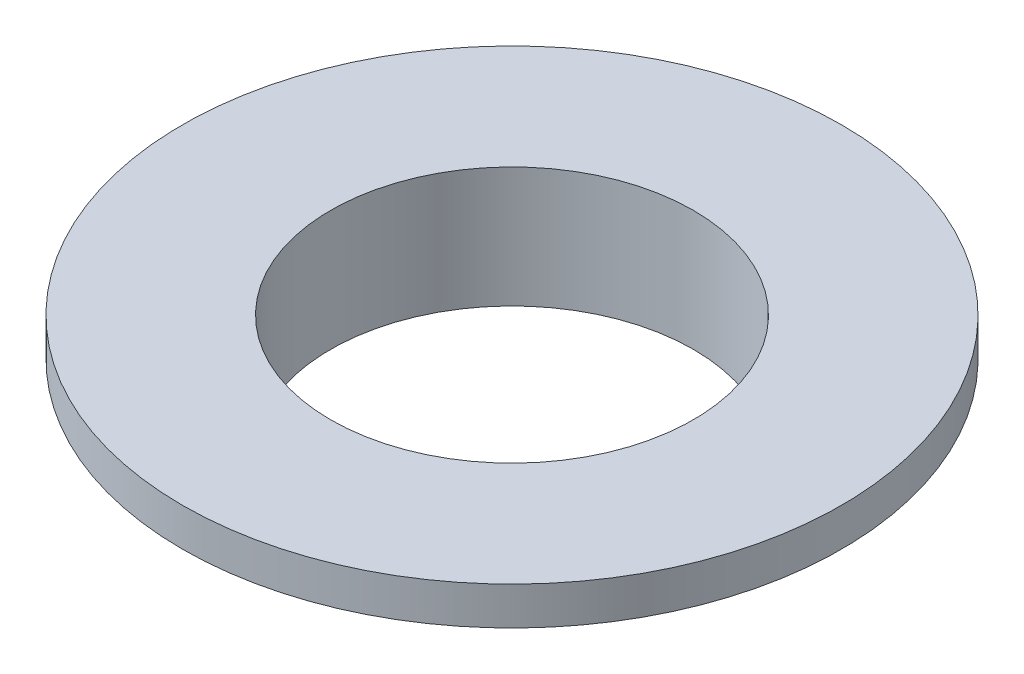
ISO-10303-21;
HEADER;
FILE_DESCRIPTION(('STEP AP214'),'2;1');
FILE_NAME('part.step','',(''),(''),'','','');
FILE_SCHEMA(('AUTOMOTIVE_DESIGN { 1 0 10303 214 1 1 1 1 }'));
ENDSEC;
DATA;
#1=APPLICATION_CONTEXT('core data for automotive mechanical design processes');
#2=APPLICATION_PROTOCOL_DEFINITION('international standard','automotive_design',2000,#1);
#3=PRODUCT_CONTEXT('',#1,'mechanical');
#4=PRODUCT('Part','Part','',(#3));
#5=PRODUCT_RELATED_PRODUCT_CATEGORY('part','',(#4));
#6=PRODUCT_DEFINITION_FORMATION('','',#4);
#7=PRODUCT_DEFINITION_CONTEXT('part definition',#1,'design');
#8=PRODUCT_DEFINITION('design','',#6,#7);
#9=PRODUCT_DEFINITION_SHAPE('','',#8);
#10=(LENGTH_UNIT() NAMED_UNIT(*) SI_UNIT(.MILLI.,.METRE.));
#11=(NAMED_UNIT(*) PLANE_ANGLE_UNIT() SI_UNIT($,.RADIAN.));
#12=(NAMED_UNIT(*) SI_UNIT($,.STERADIAN.) SOLID_ANGLE_UNIT());
#13=UNCERTAINTY_MEASURE_WITH_UNIT(LENGTH_MEASURE(1.E-05),#10,'distance_accuracy_value','');
#14=(GEOMETRIC_REPRESENTATION_CONTEXT(3) GLOBAL_UNCERTAINTY_ASSIGNED_CONTEXT((#13)) GLOBAL_UNIT_ASSIGNED_CONTEXT((#10,
#11,#12)) REPRESENTATION_CONTEXT('',''));
#15=CARTESIAN_POINT('',(0.,0.,0.));
#16=DIRECTION('',(0.,0.,1.));
#17=DIRECTION('',(1.,0.,0.));
#18=AXIS2_PLACEMENT_3D('',#15,#16,#17);
#19=CARTESIAN_POINT('',(0.,1.5,0.));
#20=DIRECTION('',(0.,-1.,0.));
#21=DIRECTION('',(0.,0.,-1.));
#22=AXIS2_PLACEMENT_3D('',#19,#20,#21);
#23=CYLINDRICAL_SURFACE('',#22,13.);
#24=CARTESIAN_POINT('',(0.,1.5,0.));
#25=DIRECTION('',(0.,1.,0.));
#26=DIRECTION('',(0.,0.,1.));
#27=AXIS2_PLACEMENT_3D('',#24,#25,#26);
#28=CIRCLE('',#27,13.);
#29=CARTESIAN_POINT('',(0.,1.5,13.));
#30=VERTEX_POINT('',#29);
#31=EDGE_CURVE('E51',#30,#30,#28,.T.);
#32=ORIENTED_EDGE('',*,*,#31,.F.);
#33=EDGE_LOOP('',(#32));
#34=FACE_BOUND('',#33,.T.);
#35=CARTESIAN_POINT('',(0.,0.,0.));
#36=DIRECTION('',(0.,1.,0.));
#37=DIRECTION('',(0.,0.,1.));
#38=AXIS2_PLACEMENT_3D('',#35,#36,#37);
#39=CIRCLE('',#38,13.);
#40=CARTESIAN_POINT('',(0.,0.,13.));
#41=VERTEX_POINT('',#40);
#42=EDGE_CURVE('E46',#41,#41,#39,.T.);
#43=ORIENTED_EDGE('',*,*,#42,.T.);
#44=EDGE_LOOP('',(#43));
#45=FACE_BOUND('',#44,.T.);
#46=ADVANCED_FACE('F43',(#34,#45),#23,.T.);
#47=CARTESIAN_POINT('',(0.,1.5,0.));
#48=DIRECTION('',(0.,1.,0.));
#49=DIRECTION('',(0.,0.,1.));
#50=AXIS2_PLACEMENT_3D('',#47,#48,#49);
#51=PLANE('',#50);
#52=CARTESIAN_POINT('',(0.,1.5,0.));
#53=DIRECTION('',(0.,1.,0.));
#54=DIRECTION('',(0.,0.,1.));
#55=AXIS2_PLACEMENT_3D('',#52,#53,#54);
#56=CIRCLE('',#55,7.1554);
#57=CARTESIAN_POINT('',(0.,1.5,7.1554));
#58=VERTEX_POINT('',#57);
#59=EDGE_CURVE('E63',#58,#58,#56,.T.);
#60=ORIENTED_EDGE('',*,*,#59,.F.);
#61=EDGE_LOOP('',(#60));
#62=FACE_BOUND('',#61,.T.);
#63=ORIENTED_EDGE('',*,*,#31,.T.);
#64=EDGE_LOOP('',(#63));
#65=FACE_BOUND('',#64,.T.);
#66=ADVANCED_FACE('F80',(#62,#65),#51,.T.);
#67=CARTESIAN_POINT('',(0.,0.,0.));
#68=DIRECTION('',(0.,1.,0.));
#69=DIRECTION('',(0.,0.,1.));
#70=AXIS2_PLACEMENT_3D('',#67,#68,#69);
#71=PLANE('',#70);
#72=CARTESIAN_POINT('',(0.,0.,0.));
#73=DIRECTION('',(0.,-1.,0.));
#74=DIRECTION('',(0.,0.,-1.));
#75=AXIS2_PLACEMENT_3D('',#72,#73,#74);
#76=CIRCLE('',#75,7.75);
#77=CARTESIAN_POINT('',(0.,0.,-7.75));
#78=VERTEX_POINT('',#77);
#79=EDGE_CURVE('E10',#78,#78,#76,.T.);
#80=ORIENTED_EDGE('',*,*,#79,.F.);
#81=EDGE_LOOP('',(#80));
#82=FACE_BOUND('',#81,.T.);
#83=ORIENTED_EDGE('',*,*,#42,.F.);
#84=EDGE_LOOP('',(#83));
#85=FACE_BOUND('',#84,.T.);
#86=ADVANCED_FACE('F83',(#82,#85),#71,.F.);
#87=CARTESIAN_POINT('',(0.,-3.25,0.));
#88=DIRECTION('',(0.,1.,0.));
#89=DIRECTION('',(0.,0.,1.));
#90=AXIS2_PLACEMENT_3D('',#87,#88,#89);
#91=CYLINDRICAL_SURFACE('',#90,7.75);
#92=CARTESIAN_POINT('',(0.,-3.25,0.));
#93=DIRECTION('',(0.,-1.,0.));
#94=DIRECTION('',(0.,0.,-1.));
#95=AXIS2_PLACEMENT_3D('',#92,#93,#94);
#96=CIRCLE('',#95,7.75);
#97=CARTESIAN_POINT('',(0.,-3.25,-7.75));
#98=VERTEX_POINT('',#97);
#99=EDGE_CURVE('E58',#98,#98,#96,.T.);
#100=ORIENTED_EDGE('',*,*,#99,.F.);
#101=EDGE_LOOP('',(#100));
#102=FACE_BOUND('',#101,.T.);
#103=ORIENTED_EDGE('',*,*,#79,.T.);
#104=EDGE_LOOP('',(#103));
#105=FACE_BOUND('',#104,.T.);
#106=ADVANCED_FACE('F94',(#102,#105),#91,.T.);
#107=CARTESIAN_POINT('',(0.,-3.25,0.));
#108=DIRECTION('',(0.,-1.,0.));
#109=DIRECTION('',(0.,0.,-1.));
#110=AXIS2_PLACEMENT_3D('',#107,#108,#109);
#111=PLANE('',#110);
#112=CARTESIAN_POINT('',(0.,-3.25,0.));
#113=DIRECTION('',(0.,1.,0.));
#114=DIRECTION('',(0.,0.,1.));
#115=AXIS2_PLACEMENT_3D('',#112,#113,#114);
#116=CIRCLE('',#115,7.1554);
#117=CARTESIAN_POINT('',(0.,-3.25,7.1554));
#118=VERTEX_POINT('',#117);
#119=EDGE_CURVE('E62',#118,#118,#116,.T.);
#120=ORIENTED_EDGE('',*,*,#119,.T.);
#121=EDGE_LOOP('',(#120));
#122=FACE_BOUND('',#121,.T.);
#123=ORIENTED_EDGE('',*,*,#99,.T.);
#124=EDGE_LOOP('',(#123));
#125=FACE_BOUND('',#124,.T.);
#126=ADVANCED_FACE('F71',(#122,#125),#111,.T.);
#127=CARTESIAN_POINT('',(0.,-3.25,0.));
#128=DIRECTION('',(0.,1.,0.));
#129=DIRECTION('',(0.,0.,1.));
#130=AXIS2_PLACEMENT_3D('',#127,#128,#129);
#131=CYLINDRICAL_SURFACE('',#130,7.1554);
#132=ORIENTED_EDGE('',*,*,#119,.F.);
#133=EDGE_LOOP('',(#132));
#134=FACE_BOUND('',#133,.T.);
#135=ORIENTED_EDGE('',*,*,#59,.T.);
#136=EDGE_LOOP('',(#135));
#137=FACE_BOUND('',#136,.T.);
#138=ADVANCED_FACE('F74',(#134,#137),#131,.F.);
#139=CLOSED_SHELL('',(#46,#66,#86,#106,#126,#138));
#140=MANIFOLD_SOLID_BREP('B2',#139);
#141=ADVANCED_BREP_SHAPE_REPRESENTATION('',(#18,#140),#14);
#142=SHAPE_DEFINITION_REPRESENTATION(#9,#141);
ENDSEC;
END-ISO-10303-21;
